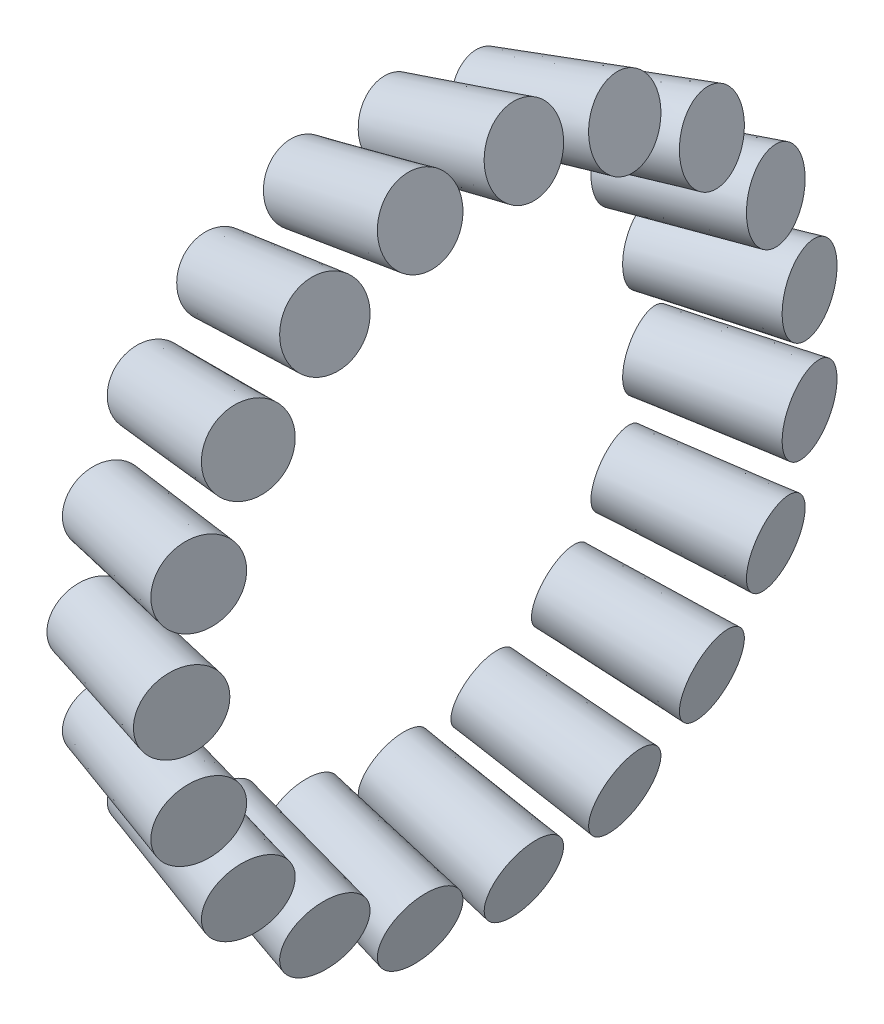
ISO-10303-21;
HEADER;
FILE_DESCRIPTION(('STEP AP214'),'2;1');
FILE_NAME('part.step','',(''),(''),'','','');
FILE_SCHEMA(('AUTOMOTIVE_DESIGN { 1 0 10303 214 1 1 1 1 }'));
ENDSEC;
DATA;
#1=APPLICATION_CONTEXT('core data for automotive mechanical design processes');
#2=APPLICATION_PROTOCOL_DEFINITION('international standard','automotive_design',2000,#1);
#3=PRODUCT_CONTEXT('',#1,'mechanical');
#4=PRODUCT('Part','Part','',(#3));
#5=PRODUCT_RELATED_PRODUCT_CATEGORY('part','',(#4));
#6=PRODUCT_DEFINITION_FORMATION('','',#4);
#7=PRODUCT_DEFINITION_CONTEXT('part definition',#1,'design');
#8=PRODUCT_DEFINITION('design','',#6,#7);
#9=PRODUCT_DEFINITION_SHAPE('','',#8);
#10=(LENGTH_UNIT() NAMED_UNIT(*) SI_UNIT(.MILLI.,.METRE.));
#11=(NAMED_UNIT(*) PLANE_ANGLE_UNIT() SI_UNIT($,.RADIAN.));
#12=(NAMED_UNIT(*) SI_UNIT($,.STERADIAN.) SOLID_ANGLE_UNIT());
#13=UNCERTAINTY_MEASURE_WITH_UNIT(LENGTH_MEASURE(1.E-05),#10,'distance_accuracy_value','');
#14=(GEOMETRIC_REPRESENTATION_CONTEXT(3) GLOBAL_UNCERTAINTY_ASSIGNED_CONTEXT((#13)) GLOBAL_UNIT_ASSIGNED_CONTEXT((#10,
#11,#12)) REPRESENTATION_CONTEXT('',''));
#15=CARTESIAN_POINT('',(0.,0.,0.));
#16=DIRECTION('',(0.,0.,1.));
#17=DIRECTION('',(1.,0.,0.));
#18=AXIS2_PLACEMENT_3D('',#15,#16,#17);
#19=CARTESIAN_POINT('',(1.5626523356005,0.,22.5310238552106));
#20=DIRECTION('',(-0.963195414363427,0.,-0.268802146102418));
#21=DIRECTION('',(-0.268802146102418,0.,0.963195414363427));
#22=AXIS2_PLACEMENT_3D('',#19,#20,#21);
#23=PLANE('',#22);
#24=CARTESIAN_POINT('',(1.9166017770261,0.,21.2627211878665));
#25=DIRECTION('',(0.963195414363428,0.,0.268802146102416));
#26=DIRECTION('',(0.268802146102416,0.,-0.963195414363428));
#27=AXIS2_PLACEMENT_3D('',#24,#25,#26);
#28=CIRCLE('',#27,2.63353136535976);
#29=CARTESIAN_POINT('',(2.62450065986283,0.,18.7261158531697));
#30=VERTEX_POINT('',#29);
#31=EDGE_CURVE('P0_E18',#30,#30,#28,.T.);
#32=ORIENTED_EDGE('',*,*,#31,.F.);
#33=EDGE_LOOP('',(#32));
#34=FACE_BOUND('',#33,.T.);
#35=ADVANCED_FACE('P0_F15',(#34),#23,.T.);
#36=CARTESIAN_POINT('',(11.1810493570371,0.,25.3887050045226));
#37=DIRECTION('',(0.963195414363427,0.,0.268802146102418));
#38=DIRECTION('',(0.268802146102418,0.,-0.963195414363427));
#39=AXIS2_PLACEMENT_3D('',#36,#37,#38);
#40=PLANE('',#39);
#41=CARTESIAN_POINT('',(11.5799047821866,0.,23.9594912798855));
#42=DIRECTION('',(0.963195414363428,0.,0.268802146102416));
#43=DIRECTION('',(0.268802146102416,0.,-0.963195414363428));
#44=AXIS2_PLACEMENT_3D('',#41,#42,#43);
#45=CIRCLE('',#44,2.96765059995608);
#46=CARTESIAN_POINT('',(12.377615632337,0.,21.1010638305749));
#47=VERTEX_POINT('',#46);
#48=EDGE_CURVE('P0_E10',#47,#47,#45,.F.);
#49=ORIENTED_EDGE('',*,*,#48,.F.);
#50=EDGE_LOOP('',(#49));
#51=FACE_BOUND('',#50,.T.);
#52=ADVANCED_FACE('P0_F30',(#51),#40,.T.);
#53=CARTESIAN_POINT('',(11.5799047820547,0.,23.9594912798486));
#54=DIRECTION('',(0.963195414363428,0.,0.268802146102416));
#55=DIRECTION('',(0.268802146102416,0.,-0.963195414363428));
#56=AXIS2_PLACEMENT_3D('',#53,#54,#55);
#57=CONICAL_SURFACE('',#56,2.96765059995151,0.0332912269457585);
#58=ORIENTED_EDGE('',*,*,#31,.T.);
#59=EDGE_LOOP('',(#58));
#60=FACE_BOUND('',#59,.T.);
#61=ORIENTED_EDGE('',*,*,#48,.T.);
#62=EDGE_LOOP('',(#61));
#63=FACE_BOUND('',#62,.T.);
#64=ADVANCED_FACE('P0_F27',(#60,#63),#57,.T.);
#65=CLOSED_SHELL('',(#35,#52,#64));
#66=MANIFOLD_SOLID_BREP('P0_B1',#65);
#67=CARTESIAN_POINT('',(1.5626523356005,-22.4540689856662,-1.8605972027848));
#68=DIRECTION('',(-0.963195414363427,0.267884050492583,0.0221975052866959));
#69=DIRECTION('',(-0.267950072044078,-0.963432799364633,0.));
#70=AXIS2_PLACEMENT_3D('',#67,#68,#69);
#71=PLANE('',#70);
#72=CARTESIAN_POINT('',(1.91660177690901,-21.1900982149196,-1.755861598652));
#73=DIRECTION('',(0.963195414363429,-0.267884050492579,-0.0221975052866969));
#74=DIRECTION('',(0.267950072044074,0.963432799364634,0.));
#75=AXIS2_PLACEMENT_3D('',#72,#73,#74);
#76=CIRCLE('',#75,2.63353136535399);
#77=CARTESIAN_POINT('',(2.62225669598594,-18.652867719382,-1.755861598652));
#78=VERTEX_POINT('',#77);
#79=EDGE_CURVE('P1_E18',#78,#78,#76,.T.);
#80=ORIENTED_EDGE('',*,*,#79,.F.);
#81=EDGE_LOOP('',(#80));
#82=FACE_BOUND('',#81,.T.);
#83=ADVANCED_FACE('P1_F15',(#82),#71,.T.);
#84=CARTESIAN_POINT('',(11.1810493570371,-25.3019897050281,-2.09658264166361));
#85=DIRECTION('',(0.963195414363427,-0.267884050492583,-0.0221975052866959));
#86=DIRECTION('',(0.267950072044078,0.963432799364633,0.));
#87=AXIS2_PLACEMENT_3D('',#84,#85,#86);
#88=PLANE('',#87);
#89=CARTESIAN_POINT('',(11.5799047822032,-23.877657469867,-1.97855910774338));
#90=DIRECTION('',(0.963195414363429,-0.267884050492579,-0.0221975052866969));
#91=DIRECTION('',(0.267950072044074,0.963432799364634,0.));
#92=AXIS2_PLACEMENT_3D('',#89,#90,#91);
#93=CIRCLE('',#92,2.96765059997999);
#94=CARTESIAN_POINT('',(12.3750869742695,-21.0185255447921,-1.97855910774338));
#95=VERTEX_POINT('',#94);
#96=EDGE_CURVE('P1_E10',#95,#95,#93,.F.);
#97=ORIENTED_EDGE('',*,*,#96,.F.);
#98=EDGE_LOOP('',(#97));
#99=FACE_BOUND('',#98,.T.);
#100=ADVANCED_FACE('P1_F30',(#99),#88,.T.);
#101=CARTESIAN_POINT('',(11.5799047821932,-23.8776574698642,-1.97855910774315));
#102=DIRECTION('',(0.963195414363429,-0.267884050492579,-0.0221975052866969));
#103=DIRECTION('',(0.267950072044074,0.963432799364634,0.));
#104=AXIS2_PLACEMENT_3D('',#101,#102,#103);
#105=CONICAL_SURFACE('',#104,2.96765059997964,0.033291226948253);
#106=ORIENTED_EDGE('',*,*,#96,.T.);
#107=EDGE_LOOP('',(#106));
#108=FACE_BOUND('',#107,.T.);
#109=ORIENTED_EDGE('',*,*,#79,.T.);
#110=EDGE_LOOP('',(#109));
#111=FACE_BOUND('',#110,.T.);
#112=ADVANCED_FACE('P1_F27',(#108,#111),#105,.T.);
#113=CLOSED_SHELL('',(#83,#100,#112));
#114=MANIFOLD_SOLID_BREP('P1_B1',#113);
#115=CARTESIAN_POINT('',(1.5626523356005,13.8388412817845,17.7801436423232));
#116=DIRECTION('',(-0.963195414363427,-0.165101695334371,-0.212122662502106));
#117=DIRECTION('',(-0.215074223164244,0.,0.976597705572923));
#118=AXIS2_PLACEMENT_3D('',#115,#116,#117);
#119=PLANE('',#118);
#120=CARTESIAN_POINT('',(1.91660177704468,13.0598336599667,16.7792746293505));
#121=DIRECTION('',(0.963195414363426,0.165101695334375,0.212122662502107));
#122=DIRECTION('',(0.215074223164245,0.,-0.976597705572922));
#123=AXIS2_PLACEMENT_3D('',#120,#121,#122);
#124=CIRCLE('',#123,2.6335313653514);
#125=CARTESIAN_POINT('',(2.48300648962631,13.0598336599667,14.207373940394));
#126=VERTEX_POINT('',#125);
#127=EDGE_CURVE('P2_E18',#126,#126,#124,.T.);
#128=ORIENTED_EDGE('',*,*,#127,.F.);
#129=EDGE_LOOP('',(#128));
#130=FACE_BOUND('',#129,.T.);
#131=ADVANCED_FACE('P2_F15',(#130),#119,.T.);
#132=CARTESIAN_POINT('',(11.1810493570371,15.5940653725056,20.0352556001837));
#133=DIRECTION('',(0.963195414363427,0.16510169533437,0.212122662502106));
#134=DIRECTION('',(0.215074223164244,0.,-0.976597705572923));
#135=AXIS2_PLACEMENT_3D('',#132,#133,#134);
#136=PLANE('',#135);
#137=CARTESIAN_POINT('',(11.5799047822593,14.7162241336953,18.9074051535033));
#138=DIRECTION('',(0.963195414363426,0.165101695334375,0.212122662502107));
#139=DIRECTION('',(0.215074223164245,0.,-0.976597705572922));
#140=AXIS2_PLACEMENT_3D('',#137,#138,#139);
#141=CIRCLE('',#140,2.96765059996206);
#142=CARTESIAN_POINT('',(12.2181699296691,14.7162241336953,16.0092043866382));
#143=VERTEX_POINT('',#142);
#144=EDGE_CURVE('P2_E10',#143,#143,#141,.F.);
#145=ORIENTED_EDGE('',*,*,#144,.F.);
#146=EDGE_LOOP('',(#145));
#147=FACE_BOUND('',#146,.T.);
#148=ADVANCED_FACE('P2_F30',(#147),#136,.T.);
#149=CARTESIAN_POINT('',(11.5799047823146,14.7162241337048,18.9074051535154));
#150=DIRECTION('',(0.963195414363426,0.165101695334375,0.212122662502107));
#151=DIRECTION('',(0.215074223164245,0.,-0.976597705572922));
#152=AXIS2_PLACEMENT_3D('',#149,#150,#151);
#153=CONICAL_SURFACE('',#152,2.96765059996397,0.0332912269470001);
#154=ORIENTED_EDGE('',*,*,#144,.T.);
#155=EDGE_LOOP('',(#154));
#156=FACE_BOUND('',#155,.T.);
#157=ORIENTED_EDGE('',*,*,#127,.T.);
#158=EDGE_LOOP('',(#157));
#159=FACE_BOUND('',#158,.T.);
#160=ADVANCED_FACE('P2_F27',(#156,#159),#153,.T.);
#161=CLOSED_SHELL('',(#131,#148,#160));
#162=MANIFOLD_SOLID_BREP('P2_B1',#161);
#163=CARTESIAN_POINT('',(1.5626523356005,18.8622178925157,12.3233019982199));
#164=DIRECTION('',(-0.963195414363427,-0.225032146001971,-0.147020838710073));
#165=DIRECTION('',(0.227504345878125,-0.973777065147135,0.));
#166=AXIS2_PLACEMENT_3D('',#163,#164,#165);
#167=PLANE('',#166);
#168=CARTESIAN_POINT('',(1.91660177700274,17.8004374151186,11.6296061903706));
#169=DIRECTION('',(0.963195414363422,0.225032146001991,0.14702083871008));
#170=DIRECTION('',(-0.227504345878145,0.97377706514713,0.));
#171=AXIS2_PLACEMENT_3D('',#168,#169,#170);
#172=CIRCLE('',#171,2.63353136538004);
#173=CARTESIAN_POINT('',(1.31746194637238,20.3649098590713,11.6296061903706));
#174=VERTEX_POINT('',#173);
#175=EDGE_CURVE('P3_E18',#174,#174,#172,.T.);
#176=ORIENTED_EDGE('',*,*,#175,.F.);
#177=EDGE_LOOP('',(#176));
#178=FACE_BOUND('',#177,.T.);
#179=ADVANCED_FACE('P3_F15',(#178),#167,.T.);
#180=CARTESIAN_POINT('',(11.1810493570371,21.2545727562824,13.8863054393373));
#181=DIRECTION('',(0.963195414363427,0.225032146001971,0.147020838710073));
#182=DIRECTION('',(-0.227504345878125,0.973777065147135,0.));
#183=AXIS2_PLACEMENT_3D('',#180,#181,#182);
#184=PLANE('',#183);
#185=CARTESIAN_POINT('',(11.5799047820923,20.0580829357214,13.1045996250693));
#186=DIRECTION('',(0.963195414363422,0.225032146001991,0.14702083871008));
#187=DIRECTION('',(-0.227504345878145,0.97377706514713,0.));
#188=AXIS2_PLACEMENT_3D('',#185,#186,#187);
#189=CIRCLE('',#188,2.96765059995125);
#190=CARTESIAN_POINT('',(10.9047513735555,22.9479130273241,13.1045996250693));
#191=VERTEX_POINT('',#190);
#192=EDGE_CURVE('P3_E10',#191,#191,#189,.F.);
#193=ORIENTED_EDGE('',*,*,#192,.F.);
#194=EDGE_LOOP('',(#193));
#195=FACE_BOUND('',#194,.T.);
#196=ADVANCED_FACE('P3_F30',(#195),#184,.T.);
#197=CARTESIAN_POINT('',(11.579904781825,20.058082935659,13.1045996250285));
#198=DIRECTION('',(0.963195414363422,0.225032146001991,0.14702083871008));
#199=DIRECTION('',(-0.227504345878145,0.97377706514713,0.));
#200=AXIS2_PLACEMENT_3D('',#197,#198,#199);
#201=CONICAL_SURFACE('',#200,2.96765059994201,0.033291226943502);
#202=ORIENTED_EDGE('',*,*,#175,.T.);
#203=EDGE_LOOP('',(#202));
#204=FACE_BOUND('',#203,.T.);
#205=ORIENTED_EDGE('',*,*,#192,.T.);
#206=EDGE_LOOP('',(#205));
#207=FACE_BOUND('',#206,.T.);
#208=ADVANCED_FACE('P3_F27',(#204,#207),#201,.T.);
#209=CLOSED_SHELL('',(#179,#196,#208));
#210=MANIFOLD_SOLID_BREP('P3_B1',#209);
#211=CARTESIAN_POINT('',(1.5626523356005,-18.8622178925157,12.3233019982199));
#212=DIRECTION('',(-0.963195414363427,0.225032146001971,-0.147020838710073));
#213=DIRECTION('',(-0.227504345878125,-0.973777065147134,0.));
#214=AXIS2_PLACEMENT_3D('',#211,#212,#213);
#215=PLANE('',#214);
#216=CARTESIAN_POINT('',(1.91660177694288,-17.8004374151047,11.6296061903615));
#217=DIRECTION('',(0.963195414363423,-0.225032146001984,0.14702083871008));
#218=DIRECTION('',(0.227504345878138,0.973777065147131,0.));
#219=AXIS2_PLACEMENT_3D('',#216,#217,#218);
#220=CIRCLE('',#219,2.63353136534635);
#221=CARTESIAN_POINT('',(2.51574160756557,-15.2359649711848,11.6296061903615));
#222=VERTEX_POINT('',#221);
#223=EDGE_CURVE('P4_E18',#222,#222,#220,.T.);
#224=ORIENTED_EDGE('',*,*,#223,.F.);
#225=EDGE_LOOP('',(#224));
#226=FACE_BOUND('',#225,.T.);
#227=ADVANCED_FACE('P4_F15',(#226),#215,.T.);
#228=CARTESIAN_POINT('',(11.1810493570371,-21.2545727562824,13.8863054393373));
#229=DIRECTION('',(0.963195414363427,-0.225032146001971,0.147020838710073));
#230=DIRECTION('',(0.227504345878125,0.973777065147134,0.));
#231=AXIS2_PLACEMENT_3D('',#228,#229,#230);
#232=PLANE('',#231);
#233=CARTESIAN_POINT('',(11.5799047823543,-20.0580829357826,13.1045996251093));
#234=DIRECTION('',(0.963195414363423,-0.225032146001984,0.14702083871008));
#235=DIRECTION('',(0.227504345878138,0.973777065147131,0.));
#236=AXIS2_PLACEMENT_3D('',#233,#234,#235);
#237=CIRCLE('',#236,2.96765059996146);
#238=CARTESIAN_POINT('',(12.2550581908934,-17.1682528441701,13.1045996251093));
#239=VERTEX_POINT('',#238);
#240=EDGE_CURVE('P4_E10',#239,#239,#237,.F.);
#241=ORIENTED_EDGE('',*,*,#240,.F.);
#242=EDGE_LOOP('',(#241));
#243=FACE_BOUND('',#242,.T.);
#244=ADVANCED_FACE('P4_F30',(#243),#232,.T.);
#245=CARTESIAN_POINT('',(11.5799047822211,-20.0580829357515,13.104599625089));
#246=DIRECTION('',(0.963195414363423,-0.225032146001984,0.14702083871008));
#247=DIRECTION('',(0.227504345878138,0.973777065147131,0.));
#248=AXIS2_PLACEMENT_3D('',#245,#246,#247);
#249=CONICAL_SURFACE('',#248,2.96765059995685,0.033291226946765);
#250=ORIENTED_EDGE('',*,*,#240,.T.);
#251=EDGE_LOOP('',(#250));
#252=FACE_BOUND('',#251,.T.);
#253=ORIENTED_EDGE('',*,*,#223,.T.);
#254=EDGE_LOOP('',(#253));
#255=FACE_BOUND('',#254,.T.);
#256=ADVANCED_FACE('P4_F27',(#252,#255),#249,.T.);
#257=CLOSED_SHELL('',(#227,#244,#256));
#258=MANIFOLD_SOLID_BREP('P4_B1',#257);
#259=CARTESIAN_POINT('',(1.5626523356005,22.4540689856662,-1.86059720278479));
#260=DIRECTION('',(-0.963195414363427,-0.267884050492583,0.0221975052866957));
#261=DIRECTION('',(0.267950072044078,-0.963432799364633,0.));
#262=AXIS2_PLACEMENT_3D('',#259,#260,#261);
#263=PLANE('',#262);
#264=CARTESIAN_POINT('',(1.91660177702257,21.190098214951,-1.75586159865461));
#265=DIRECTION('',(0.963195414363425,0.267884050492593,-0.0221975052866964));
#266=DIRECTION('',(-0.267950072044088,0.96343279936463,0.));
#267=AXIS2_PLACEMENT_3D('',#264,#265,#266);
#268=CIRCLE('',#267,2.63353136533571);
#269=CARTESIAN_POINT('',(1.2109468579505,23.727328710471,-1.75586159865461));
#270=VERTEX_POINT('',#269);
#271=EDGE_CURVE('P5_E18',#270,#270,#268,.T.);
#272=ORIENTED_EDGE('',*,*,#271,.F.);
#273=EDGE_LOOP('',(#272));
#274=FACE_BOUND('',#273,.T.);
#275=ADVANCED_FACE('P5_F15',(#274),#263,.T.);
#276=CARTESIAN_POINT('',(11.1810493570371,25.3019897050281,-2.09658264166359));
#277=DIRECTION('',(0.963195414363427,0.267884050492583,-0.0221975052866957));
#278=DIRECTION('',(-0.267950072044078,0.963432799364633,0.));
#279=AXIS2_PLACEMENT_3D('',#276,#277,#278);
#280=PLANE('',#279);
#281=CARTESIAN_POINT('',(11.5799047820702,23.87765746983,-1.9785591077403));
#282=DIRECTION('',(0.963195414363425,0.267884050492593,-0.0221975052866964));
#283=DIRECTION('',(-0.267950072044088,0.96343279936463,0.));
#284=AXIS2_PLACEMENT_3D('',#281,#282,#283);
#285=CIRCLE('',#284,2.96765059995395);
#286=CARTESIAN_POINT('',(10.7847225900108,26.7367893948797,-1.9785591077403));
#287=VERTEX_POINT('',#286);
#288=EDGE_CURVE('P5_E10',#287,#287,#285,.F.);
#289=ORIENTED_EDGE('',*,*,#288,.F.);
#290=EDGE_LOOP('',(#289));
#291=FACE_BOUND('',#290,.T.);
#292=ADVANCED_FACE('P5_F30',(#291),#280,.T.);
#293=CARTESIAN_POINT('',(11.5799047819619,23.8776574697999,-1.9785591077378));
#294=DIRECTION('',(0.963195414363425,0.267884050492593,-0.0221975052866964));
#295=DIRECTION('',(-0.267950072044088,0.96343279936463,0.));
#296=AXIS2_PLACEMENT_3D('',#293,#294,#295);
#297=CONICAL_SURFACE('',#296,2.96765059995021,0.0332912269483301);
#298=ORIENTED_EDGE('',*,*,#271,.T.);
#299=EDGE_LOOP('',(#298));
#300=FACE_BOUND('',#299,.T.);
#301=ORIENTED_EDGE('',*,*,#288,.T.);
#302=EDGE_LOOP('',(#301));
#303=FACE_BOUND('',#302,.T.);
#304=ADVANCED_FACE('P5_F27',(#300,#303),#297,.T.);
#305=CLOSED_SHELL('',(#275,#292,#304));
#306=MANIFOLD_SOLID_BREP('P5_B1',#305);
#307=CARTESIAN_POINT('',(1.5626523356005,-3.70848464005382,-22.2237300568234));
#308=DIRECTION('',(-0.963195414363427,0.0442433791043094,0.26513603518703));
#309=DIRECTION('',(0.265395915573286,0.,0.964139516873475));
#310=AXIS2_PLACEMENT_3D('',#307,#308,#309);
#311=PLANE('',#310);
#312=CARTESIAN_POINT('',(1.91660177689485,-3.49972888216432,-20.9727253847165));
#313=DIRECTION('',(0.963195414363426,-0.0442433791043105,-0.265136035187036));
#314=DIRECTION('',(-0.265395915573292,0.,-0.964139516873473));
#315=AXIS2_PLACEMENT_3D('',#312,#313,#314);
#316=CIRCLE('',#315,2.6335313653806);
#317=CARTESIAN_POINT('',(1.21767330898869,-3.49972888216432,-23.5118170430057));
#318=VERTEX_POINT('',#317);
#319=EDGE_CURVE('P6_E18',#318,#318,#316,.T.);
#320=ORIENTED_EDGE('',*,*,#319,.F.);
#321=EDGE_LOOP('',(#320));
#322=FACE_BOUND('',#321,.T.);
#323=ADVANCED_FACE('P6_F15',(#322),#311,.T.);
#324=CARTESIAN_POINT('',(11.1810493570371,-4.17884349797781,-25.0424361599681));
#325=DIRECTION('',(0.963195414363427,-0.0442433791043094,-0.26513603518703));
#326=DIRECTION('',(-0.265395915573286,0.,-0.964139516873475));
#327=AXIS2_PLACEMENT_3D('',#324,#325,#326);
#328=PLANE('',#327);
#329=CARTESIAN_POINT('',(11.5799047822645,-3.94360265055113,-23.6327150477154));
#330=DIRECTION('',(0.963195414363426,-0.0442433791043105,-0.265136035187036));
#331=DIRECTION('',(-0.265395915573292,0.,-0.964139516873473));
#332=AXIS2_PLACEMENT_3D('',#329,#330,#331);
#333=CIRCLE('',#332,2.96765060000158);
#334=CARTESIAN_POINT('',(10.7923024341755,-3.94360265055113,-26.4939442634502));
#335=VERTEX_POINT('',#334);
#336=EDGE_CURVE('P6_E10',#335,#335,#333,.F.);
#337=ORIENTED_EDGE('',*,*,#336,.F.);
#338=EDGE_LOOP('',(#337));
#339=FACE_BOUND('',#338,.T.);
#340=ADVANCED_FACE('P6_F30',(#339),#328,.T.);
#341=CARTESIAN_POINT('',(11.5799047821715,-3.94360265054686,-23.6327150476898));
#342=DIRECTION('',(0.963195414363426,-0.0442433791043105,-0.265136035187036));
#343=DIRECTION('',(-0.265395915573292,0.,-0.964139516873473));
#344=AXIS2_PLACEMENT_3D('',#341,#342,#343);
#345=CONICAL_SURFACE('',#344,2.96765059999837,0.0332912269474935);
#346=ORIENTED_EDGE('',*,*,#319,.T.);
#347=EDGE_LOOP('',(#346));
#348=FACE_BOUND('',#347,.T.);
#349=ORIENTED_EDGE('',*,*,#336,.T.);
#350=EDGE_LOOP('',(#349));
#351=FACE_BOUND('',#350,.T.);
#352=ADVANCED_FACE('P6_F27',(#348,#351),#345,.T.);
#353=CLOSED_SHELL('',(#323,#340,#352));
#354=MANIFOLD_SOLID_BREP('P6_B1',#353);
#355=CARTESIAN_POINT('',(1.5626523356005,-13.8388412817845,17.7801436423232));
#356=DIRECTION('',(-0.963195414363427,0.165101695334371,-0.212122662502106));
#357=DIRECTION('',(-0.215074223164244,0.,0.976597705572923));
#358=AXIS2_PLACEMENT_3D('',#355,#356,#357);
#359=PLANE('',#358);
#360=CARTESIAN_POINT('',(1.91660177698386,-13.0598336599563,16.7792746293371));
#361=DIRECTION('',(0.963195414363425,-0.165101695334375,0.212122662502115));
#362=DIRECTION('',(0.215074223164253,0.,-0.976597705572921));
#363=AXIS2_PLACEMENT_3D('',#360,#361,#362);
#364=CIRCLE('',#363,2.63353136536383);
#365=CARTESIAN_POINT('',(2.48300648956818,-13.0598336599563,14.2073739403684));
#366=VERTEX_POINT('',#365);
#367=EDGE_CURVE('P7_E18',#366,#366,#364,.T.);
#368=ORIENTED_EDGE('',*,*,#367,.F.);
#369=EDGE_LOOP('',(#368));
#370=FACE_BOUND('',#369,.T.);
#371=ADVANCED_FACE('P7_F15',(#370),#359,.T.);
#372=CARTESIAN_POINT('',(11.1810493570371,-15.5940653725056,20.0352556001837));
#373=DIRECTION('',(0.963195414363427,-0.165101695334371,0.212122662502106));
#374=DIRECTION('',(0.215074223164244,0.,-0.976597705572923));
#375=AXIS2_PLACEMENT_3D('',#372,#373,#374);
#376=PLANE('',#375);
#377=CARTESIAN_POINT('',(11.5799047823056,-14.7162241337033,18.9074051535135));
#378=DIRECTION('',(0.963195414363425,-0.165101695334375,0.212122662502115));
#379=DIRECTION('',(0.215074223164253,0.,-0.976597705572921));
#380=AXIS2_PLACEMENT_3D('',#377,#378,#379);
#381=CIRCLE('',#380,2.96765059999527);
#382=CARTESIAN_POINT('',(12.2181699297225,-14.7162241337033,16.009204386616));
#383=VERTEX_POINT('',#382);
#384=EDGE_CURVE('P7_E10',#383,#383,#381,.F.);
#385=ORIENTED_EDGE('',*,*,#384,.F.);
#386=EDGE_LOOP('',(#385));
#387=FACE_BOUND('',#386,.T.);
#388=ADVANCED_FACE('P7_F30',(#387),#376,.T.);
#389=CARTESIAN_POINT('',(11.5799047822508,-14.7162241336939,18.9074051535014));
#390=DIRECTION('',(0.963195414363425,-0.165101695334375,0.212122662502115));
#391=DIRECTION('',(0.215074223164253,0.,-0.976597705572921));
#392=AXIS2_PLACEMENT_3D('',#389,#390,#391);
#393=CONICAL_SURFACE('',#392,2.96765059999338,0.0332912269487001);
#394=ORIENTED_EDGE('',*,*,#384,.T.);
#395=EDGE_LOOP('',(#394));
#396=FACE_BOUND('',#395,.T.);
#397=ORIENTED_EDGE('',*,*,#367,.T.);
#398=EDGE_LOOP('',(#397));
#399=FACE_BOUND('',#398,.T.);
#400=ADVANCED_FACE('P7_F27',(#396,#399),#393,.T.);
#401=CLOSED_SHELL('',(#371,#388,#400));
#402=MANIFOLD_SOLID_BREP('P7_B1',#401);
#403=CARTESIAN_POINT('',(1.5626523356005,-10.7235820663436,-19.815444068465));
#404=DIRECTION('',(-0.963195414363427,0.127935680680216,0.236404431765048));
#405=DIRECTION('',(0.238363189166818,0.,0.971176086016446));
#406=AXIS2_PLACEMENT_3D('',#403,#404,#405);
#407=PLANE('',#406);
#408=CARTESIAN_POINT('',(1.91660177704585,-10.1199367182418,-18.7000051639554));
#409=DIRECTION('',(0.963195414363424,-0.12793568068022,-0.236404431765058));
#410=DIRECTION('',(-0.238363189166828,0.,-0.971176086016444));
#411=AXIS2_PLACEMENT_3D('',#408,#409,#410);
#412=CIRCLE('',#411,2.63353136537429);
#413=CARTESIAN_POINT('',(1.28886484202436,-10.1199367182418,-21.2576278477811));
#414=VERTEX_POINT('',#413);
#415=EDGE_CURVE('P8_E18',#414,#414,#412,.T.);
#416=ORIENTED_EDGE('',*,*,#415,.F.);
#417=EDGE_LOOP('',(#416));
#418=FACE_BOUND('',#417,.T.);
#419=ADVANCED_FACE('P8_F15',(#418),#407,.T.);
#420=CARTESIAN_POINT('',(11.1810493570371,-12.0836879594898,-22.3286996286025));
#421=DIRECTION('',(0.963195414363427,-0.127935680680216,-0.236404431765048));
#422=DIRECTION('',(-0.238363189166818,0.,-0.971176086016446));
#423=AXIS2_PLACEMENT_3D('',#420,#421,#422);
#424=PLANE('',#423);
#425=CARTESIAN_POINT('',(11.5799047820376,-11.4034574131362,-21.0717436728834));
#426=DIRECTION('',(0.963195414363424,-0.12793568068022,-0.236404431765058));
#427=DIRECTION('',(-0.238363189166828,0.,-0.971176086016444));
#428=AXIS2_PLACEMENT_3D('',#425,#426,#427);
#429=CIRCLE('',#428,2.96765059996377);
#430=CARTESIAN_POINT('',(10.8725261206974,-11.4034574131362,-23.9538549672206));
#431=VERTEX_POINT('',#430);
#432=EDGE_CURVE('P8_E10',#431,#431,#429,.F.);
#433=ORIENTED_EDGE('',*,*,#432,.F.);
#434=EDGE_LOOP('',(#433));
#435=FACE_BOUND('',#434,.T.);
#436=ADVANCED_FACE('P8_F30',(#435),#424,.T.);
#437=CARTESIAN_POINT('',(11.5799047819769,-11.4034574131281,-21.0717436728685));
#438=DIRECTION('',(0.963195414363424,-0.12793568068022,-0.236404431765058));
#439=DIRECTION('',(-0.238363189166828,0.,-0.971176086016444));
#440=AXIS2_PLACEMENT_3D('',#437,#438,#439);
#441=CONICAL_SURFACE('',#440,2.96765059996167,0.0332912269456588);
#442=ORIENTED_EDGE('',*,*,#432,.T.);
#443=EDGE_LOOP('',(#442));
#444=FACE_BOUND('',#443,.T.);
#445=ORIENTED_EDGE('',*,*,#415,.T.);
#446=EDGE_LOOP('',(#445));
#447=FACE_BOUND('',#446,.T.);
#448=ADVANCED_FACE('P8_F27',(#444,#447),#441,.T.);
#449=CLOSED_SHELL('',(#419,#436,#448));
#450=MANIFOLD_SOLID_BREP('P8_B1',#449);
#451=CARTESIAN_POINT('',(1.5626523356005,-20.6333106688307,-9.05060919538501));
#452=DIRECTION('',(-0.963195414363427,0.24616183554823,0.10797659222624));
#453=DIRECTION('',(-0.247609500186071,-0.968859915270316,0.));
#454=AXIS2_PLACEMENT_3D('',#451,#452,#453);
#455=PLANE('',#454);
#456=CARTESIAN_POINT('',(1.91660177700679,-19.4718329159465,-8.54113781683553));
#457=DIRECTION('',(0.963195414363426,-0.246161835548235,-0.107976592226243));
#458=DIRECTION('',(0.247609500186076,0.968859915270315,0.));
#459=AXIS2_PLACEMENT_3D('',#456,#457,#458);
#460=CIRCLE('',#459,2.63353136533118);
#461=CARTESIAN_POINT('',(2.5686891621008,-16.92030994047,-8.54113781683553));
#462=VERTEX_POINT('',#461);
#463=EDGE_CURVE('P9_E18',#462,#462,#460,.T.);
#464=ORIENTED_EDGE('',*,*,#463,.F.);
#465=EDGE_LOOP('',(#464));
#466=FACE_BOUND('',#465,.T.);
#467=ADVANCED_FACE('P9_F15',(#466),#455,.T.);
#468=CARTESIAN_POINT('',(11.1810493570371,-23.2502988414556,-10.1985266381807));
#469=DIRECTION('',(0.963195414363427,-0.24616183554823,-0.10797659222624));
#470=DIRECTION('',(0.247609500186071,0.968859915270316,0.));
#471=AXIS2_PLACEMENT_3D('',#468,#469,#470);
#472=PLANE('',#471);
#473=CARTESIAN_POINT('',(11.5799047821834,-21.9414630343427,-9.62441802414235));
#474=DIRECTION('',(0.963195414363426,-0.246161835548235,-0.107976592226243));
#475=DIRECTION('',(0.247609500186076,0.968859915270315,0.));
#476=AXIS2_PLACEMENT_3D('',#473,#474,#475);
#477=CIRCLE('',#476,2.96765059997153);
#478=CARTESIAN_POINT('',(12.3147232639693,-19.0662253255024,-9.62441802414235));
#479=VERTEX_POINT('',#478);
#480=EDGE_CURVE('P9_E10',#479,#479,#477,.F.);
#481=ORIENTED_EDGE('',*,*,#480,.F.);
#482=EDGE_LOOP('',(#481));
#483=FACE_BOUND('',#482,.T.);
#484=ADVANCED_FACE('P9_F30',(#483),#472,.T.);
#485=CARTESIAN_POINT('',(11.5799047820565,-21.9414630343103,-9.62441802412812));
#486=DIRECTION('',(0.963195414363426,-0.246161835548235,-0.107976592226243));
#487=DIRECTION('',(0.247609500186076,0.968859915270315,0.));
#488=AXIS2_PLACEMENT_3D('',#485,#486,#487);
#489=CONICAL_SURFACE('',#488,2.96765059996714,0.0332912269500875);
#490=ORIENTED_EDGE('',*,*,#480,.T.);
#491=EDGE_LOOP('',(#490));
#492=FACE_BOUND('',#491,.T.);
#493=ORIENTED_EDGE('',*,*,#463,.T.);
#494=EDGE_LOOP('',(#493));
#495=FACE_BOUND('',#494,.T.);
#496=ADVANCED_FACE('P9_F27',(#492,#495),#489,.T.);
#497=CLOSED_SHELL('',(#467,#484,#496));
#498=MANIFOLD_SOLID_BREP('P9_B1',#497);
#499=CARTESIAN_POINT('',(1.5626523356005,-7.31581148642494,21.3102308354265));
#500=DIRECTION('',(-0.963195414363427,0.0872799141605349,-0.2542377043898));
#501=DIRECTION('',(-0.255211636221095,0.,0.966885215905876));
#502=AXIS2_PLACEMENT_3D('',#499,#500,#501);
#503=PLANE('',#502);
#504=CARTESIAN_POINT('',(1.91660177694899,-6.90399428354041,20.110648304937));
#505=DIRECTION('',(0.963195414363424,-0.0872799141605375,0.254237704389812));
#506=DIRECTION('',(0.255211636221108,0.,-0.966885215905872));
#507=AXIS2_PLACEMENT_3D('',#504,#505,#506);
#508=CIRCLE('',#507,2.63353136535663);
#509=CARTESIAN_POINT('',(2.58870962574127,-6.90399428354041,17.5643257621493));
#510=VERTEX_POINT('',#509);
#511=EDGE_CURVE('P10_E18',#510,#510,#508,.T.);
#512=ORIENTED_EDGE('',*,*,#511,.F.);
#513=EDGE_LOOP('',(#512));
#514=FACE_BOUND('',#513,.T.);
#515=ADVANCED_FACE('P10_F15',(#514),#503,.T.);
#516=CARTESIAN_POINT('',(11.1810493570371,-8.24369903876278,24.0130749377287));
#517=DIRECTION('',(0.963195414363427,-0.0872799141605349,0.2542377043898));
#518=DIRECTION('',(0.255211636221095,0.,-0.966885215905876));
#519=AXIS2_PLACEMENT_3D('',#516,#517,#518);
#520=PLANE('',#519);
#521=CARTESIAN_POINT('',(11.5799047823113,-7.77963410100434,22.6612999549246));
#522=DIRECTION('',(0.963195414363424,-0.0872799141605375,0.254237704389812));
#523=DIRECTION('',(0.255211636221108,0.,-0.966885215905872));
#524=AXIS2_PLACEMENT_3D('',#521,#522,#523);
#525=CIRCLE('',#524,2.96765059997582);
#526=CARTESIAN_POINT('',(12.3372837476637,-7.77963410100434,19.7919224638338));
#527=VERTEX_POINT('',#526);
#528=EDGE_CURVE('P10_E10',#527,#527,#525,.F.);
#529=ORIENTED_EDGE('',*,*,#528,.F.);
#530=EDGE_LOOP('',(#529));
#531=FACE_BOUND('',#530,.T.);
#532=ADVANCED_FACE('P10_F30',(#531),#520,.T.);
#533=CARTESIAN_POINT('',(11.579904782331,-7.77963410100613,22.6612999549298));
#534=DIRECTION('',(0.963195414363424,-0.0872799141605375,0.254237704389812));
#535=DIRECTION('',(0.255211636221108,0.,-0.966885215905872));
#536=AXIS2_PLACEMENT_3D('',#533,#534,#535);
#537=CONICAL_SURFACE('',#536,2.9676505999765,0.0332912269473411);
#538=ORIENTED_EDGE('',*,*,#528,.T.);
#539=EDGE_LOOP('',(#538));
#540=FACE_BOUND('',#539,.T.);
#541=ORIENTED_EDGE('',*,*,#511,.T.);
#542=EDGE_LOOP('',(#541));
#543=FACE_BOUND('',#542,.T.);
#544=ADVANCED_FACE('P10_F27',(#540,#543),#537,.T.);
#545=CLOSED_SHELL('',(#515,#532,#544));
#546=MANIFOLD_SOLID_BREP('P10_B1',#545);
#547=CARTESIAN_POINT('',(1.5626523356005,7.31581148642493,21.3102308354265));
#548=DIRECTION('',(-0.963195414363427,-0.0872799141605348,-0.2542377043898));
#549=DIRECTION('',(-0.255211636221095,0.,0.966885215905876));
#550=AXIS2_PLACEMENT_3D('',#547,#548,#549);
#551=PLANE('',#550);
#552=CARTESIAN_POINT('',(1.91660177693854,6.90399428353943,20.1106483049344));
#553=DIRECTION('',(0.963195414363426,0.0872799141605394,0.254237704389804));
#554=DIRECTION('',(0.255211636221099,0.,-0.966885215905874));
#555=AXIS2_PLACEMENT_3D('',#552,#553,#554);
#556=CIRCLE('',#555,2.63353136539794);
#557=CARTESIAN_POINT('',(2.58870962574133,6.90399428353943,17.5643257621067));
#558=VERTEX_POINT('',#557);
#559=EDGE_CURVE('P11_E18',#558,#558,#556,.T.);
#560=ORIENTED_EDGE('',*,*,#559,.F.);
#561=EDGE_LOOP('',(#560));
#562=FACE_BOUND('',#561,.T.);
#563=ADVANCED_FACE('P11_F15',(#562),#551,.T.);
#564=CARTESIAN_POINT('',(11.1810493570371,8.24369903876277,24.0130749377287));
#565=DIRECTION('',(0.963195414363427,0.0872799141605348,0.2542377043898));
#566=DIRECTION('',(0.255211636221095,0.,-0.966885215905876));
#567=AXIS2_PLACEMENT_3D('',#564,#565,#566);
#568=PLANE('',#567);
#569=CARTESIAN_POINT('',(11.5799047821379,7.77963410098862,22.6612999548788));
#570=DIRECTION('',(0.963195414363426,0.0872799141605394,0.254237704389804));
#571=DIRECTION('',(0.255211636221099,0.,-0.966885215905874));
#572=AXIS2_PLACEMENT_3D('',#569,#570,#571);
#573=CIRCLE('',#572,2.96765060000469);
#574=CARTESIAN_POINT('',(12.3372837474976,7.77963410098862,19.7919224637601));
#575=VERTEX_POINT('',#574);
#576=EDGE_CURVE('P11_E10',#575,#575,#573,.F.);
#577=ORIENTED_EDGE('',*,*,#576,.F.);
#578=EDGE_LOOP('',(#577));
#579=FACE_BOUND('',#578,.T.);
#580=ADVANCED_FACE('P11_F30',(#579),#568,.T.);
#581=CARTESIAN_POINT('',(11.5799047819844,7.77963410097471,22.6612999548383));
#582=DIRECTION('',(0.963195414363426,0.0872799141605394,0.254237704389804));
#583=DIRECTION('',(0.255211636221099,0.,-0.966885215905874));
#584=AXIS2_PLACEMENT_3D('',#581,#582,#583);
#585=CONICAL_SURFACE('',#584,2.96765059999938,0.0332912269466634);
#586=ORIENTED_EDGE('',*,*,#576,.T.);
#587=EDGE_LOOP('',(#586));
#588=FACE_BOUND('',#587,.T.);
#589=ORIENTED_EDGE('',*,*,#559,.T.);
#590=EDGE_LOOP('',(#589));
#591=FACE_BOUND('',#590,.T.);
#592=ADVANCED_FACE('P11_F27',(#588,#591),#585,.T.);
#593=CLOSED_SHELL('',(#563,#580,#592));
#594=MANIFOLD_SOLID_BREP('P11_B1',#593);
#595=CARTESIAN_POINT('',(1.5626523356005,-16.5766129822252,-15.2598472469941));
#596=DIRECTION('',(-0.963195414363427,0.197764166127801,0.182054739968618));
#597=DIRECTION('',(-0.201125292165767,-0.979565524531787,0.));
#598=AXIS2_PLACEMENT_3D('',#595,#596,#597);
#599=PLANE('',#598);
#600=CARTESIAN_POINT('',(1.91660177705357,-15.6434923838951,-14.4008492231633));
#601=DIRECTION('',(0.963195414363425,-0.19776416612781,-0.182054739968622));
#602=DIRECTION('',(0.201125292165776,0.979565524531785,0.));
#603=AXIS2_PLACEMENT_3D('',#600,#601,#602);
#604=CIRCLE('',#603,2.63353136535541);
#605=CARTESIAN_POINT('',(2.44627154233841,-13.0637758506199,-14.4008492231633));
#606=VERTEX_POINT('',#605);
#607=EDGE_CURVE('P12_E18',#606,#606,#604,.T.);
#608=ORIENTED_EDGE('',*,*,#607,.F.);
#609=EDGE_LOOP('',(#608));
#610=FACE_BOUND('',#609,.T.);
#611=ADVANCED_FACE('P12_F15',(#610),#599,.T.);
#612=CARTESIAN_POINT('',(11.1810493570371,-18.6790773328539,-17.1953020270054));
#613=DIRECTION('',(0.963195414363427,-0.197764166127801,-0.182054739968618));
#614=DIRECTION('',(0.201125292165767,0.979565524531787,0.));
#615=AXIS2_PLACEMENT_3D('',#612,#613,#614);
#616=PLANE('',#615);
#617=CARTESIAN_POINT('',(11.5799047821433,-17.6275706221672,-16.2273219093859));
#618=DIRECTION('',(0.963195414363425,-0.19776416612781,-0.182054739968622));
#619=DIRECTION('',(0.201125292165776,0.979565524531785,0.));
#620=AXIS2_PLACEMENT_3D('',#617,#618,#619);
#621=CIRCLE('',#620,2.96765059994802);
#622=CARTESIAN_POINT('',(12.1767743761038,-14.7205624056021,-16.2273219093859));
#623=VERTEX_POINT('',#622);
#624=EDGE_CURVE('P12_E10',#623,#623,#621,.F.);
#625=ORIENTED_EDGE('',*,*,#624,.F.);
#626=EDGE_LOOP('',(#625));
#627=FACE_BOUND('',#626,.T.);
#628=ADVANCED_FACE('P12_F30',(#627),#616,.T.);
#629=CARTESIAN_POINT('',(11.579904782293,-17.627570622198,-16.2273219094142));
#630=DIRECTION('',(0.963195414363425,-0.19776416612781,-0.182054739968622));
#631=DIRECTION('',(0.201125292165776,0.979565524531785,0.));
#632=AXIS2_PLACEMENT_3D('',#629,#630,#631);
#633=CONICAL_SURFACE('',#632,2.96765059995319,0.0332912269456329);
#634=ORIENTED_EDGE('',*,*,#624,.T.);
#635=EDGE_LOOP('',(#634));
#636=FACE_BOUND('',#635,.T.);
#637=ORIENTED_EDGE('',*,*,#607,.T.);
#638=EDGE_LOOP('',(#637));
#639=FACE_BOUND('',#638,.T.);
#640=ADVANCED_FACE('P12_F27',(#636,#639),#633,.T.);
#641=CLOSED_SHELL('',(#611,#628,#640));
#642=MANIFOLD_SOLID_BREP('P12_B1',#641);
#643=CARTESIAN_POINT('',(1.5626523356005,-21.8415805171266,5.53103936687734));
#644=DIRECTION('',(-0.963195414363427,0.260576871916747,-0.0659870257804444));
#645=DIRECTION('',(-0.261146044666439,-0.965299302473111,0.));
#646=AXIS2_PLACEMENT_3D('',#643,#644,#645);
#647=PLANE('',#646);
#648=CARTESIAN_POINT('',(1.91660177702222,-20.6120875741105,5.21968946874209));
#649=DIRECTION('',(0.963195414363426,-0.260576871916752,0.0659870257804476));
#650=DIRECTION('',(0.261146044666445,0.965299302473109,0.));
#651=AXIS2_PLACEMENT_3D('',#648,#649,#650);
#652=CIRCLE('',#651,2.63353136537593);
#653=CARTESIAN_POINT('',(2.60433807659516,-18.0699415840721,5.21968946874209));
#654=VERTEX_POINT('',#653);
#655=EDGE_CURVE('P13_E18',#654,#654,#652,.T.);
#656=ORIENTED_EDGE('',*,*,#655,.F.);
#657=EDGE_LOOP('',(#656));
#658=FACE_BOUND('',#657,.T.);
#659=ADVANCED_FACE('P13_F15',(#658),#647,.T.);
#660=CARTESIAN_POINT('',(11.1810493570371,-24.6118173832394,6.23255861590927));
#661=DIRECTION('',(0.963195414363427,-0.260576871916747,0.0659870257804444));
#662=DIRECTION('',(0.261146044666439,0.965299302473111,0.));
#663=AXIS2_PLACEMENT_3D('',#660,#661,#662);
#664=PLANE('',#663);
#665=CARTESIAN_POINT('',(11.5799047820962,-23.2263372184675,5.88170738848221));
#666=DIRECTION('',(0.963195414363426,-0.260576871916752,0.0659870257804476));
#667=DIRECTION('',(0.261146044666445,0.965299302473109,0.));
#668=AXIS2_PLACEMENT_3D('',#665,#666,#667);
#669=CIRCLE('',#668,2.96765059998148);
#670=CARTESIAN_POINT('',(12.3548949982333,-20.3616661643215,5.88170738848221));
#671=VERTEX_POINT('',#670);
#672=EDGE_CURVE('P13_E10',#671,#671,#669,.F.);
#673=ORIENTED_EDGE('',*,*,#672,.F.);
#674=EDGE_LOOP('',(#673));
#675=FACE_BOUND('',#674,.T.);
#676=ADVANCED_FACE('P13_F30',(#675),#664,.T.);
#677=CARTESIAN_POINT('',(11.5799047820885,-23.2263372184655,5.88170738848168));
#678=DIRECTION('',(0.963195414363426,-0.260576871916752,0.0659870257804476));
#679=DIRECTION('',(0.261146044666445,0.965299302473109,0.));
#680=AXIS2_PLACEMENT_3D('',#677,#678,#679);
#681=CONICAL_SURFACE('',#680,2.96765059998122,0.0332912269469757);
#682=ORIENTED_EDGE('',*,*,#655,.T.);
#683=EDGE_LOOP('',(#682));
#684=FACE_BOUND('',#683,.T.);
#685=ORIENTED_EDGE('',*,*,#672,.T.);
#686=EDGE_LOOP('',(#685));
#687=FACE_BOUND('',#686,.T.);
#688=ADVANCED_FACE('P13_F27',(#684,#687),#681,.T.);
#689=CLOSED_SHELL('',(#659,#676,#688));
#690=MANIFOLD_SOLID_BREP('P13_B1',#689);
#691=CARTESIAN_POINT('',(1.5626523356005,10.7235820663436,-19.815444068465));
#692=DIRECTION('',(-0.963195414363427,-0.127935680680217,0.236404431765048));
#693=DIRECTION('',(0.238363189166818,0.,0.971176086016446));
#694=AXIS2_PLACEMENT_3D('',#691,#692,#693);
#695=PLANE('',#694);
#696=CARTESIAN_POINT('',(1.91660177698487,10.1199367182337,-18.7000051639404));
#697=DIRECTION('',(0.963195414363425,0.12793568068022,-0.236404431765055));
#698=DIRECTION('',(-0.238363189166825,0.,-0.971176086016444));
#699=AXIS2_PLACEMENT_3D('',#696,#697,#698);
#700=CIRCLE('',#699,2.63353136535336);
#701=CARTESIAN_POINT('',(1.28886484196838,10.1199367182337,-21.2576278477459));
#702=VERTEX_POINT('',#701);
#703=EDGE_CURVE('P14_E18',#702,#702,#700,.T.);
#704=ORIENTED_EDGE('',*,*,#703,.F.);
#705=EDGE_LOOP('',(#704));
#706=FACE_BOUND('',#705,.T.);
#707=ADVANCED_FACE('P14_F15',(#706),#695,.T.);
#708=CARTESIAN_POINT('',(11.1810493570371,12.0836879594898,-22.3286996286025));
#709=DIRECTION('',(0.963195414363427,0.127935680680217,-0.236404431765048));
#710=DIRECTION('',(-0.238363189166818,0.,-0.971176086016446));
#711=AXIS2_PLACEMENT_3D('',#708,#709,#710);
#712=PLANE('',#711);
#713=CARTESIAN_POINT('',(11.5799047821461,11.4034574131506,-21.0717436729101));
#714=DIRECTION('',(0.963195414363425,0.12793568068022,-0.236404431765055));
#715=DIRECTION('',(-0.238363189166825,0.,-0.971176086016444));
#716=AXIS2_PLACEMENT_3D('',#713,#714,#715);
#717=CIRCLE('',#716,2.96765059994873);
#718=CARTESIAN_POINT('',(10.8725261208094,11.4034574131506,-23.9538549672326));
#719=VERTEX_POINT('',#718);
#720=EDGE_CURVE('P14_E10',#719,#719,#717,.F.);
#721=ORIENTED_EDGE('',*,*,#720,.F.);
#722=EDGE_LOOP('',(#721));
#723=FACE_BOUND('',#722,.T.);
#724=ADVANCED_FACE('P14_F30',(#723),#712,.T.);
#725=CARTESIAN_POINT('',(11.5799047821433,11.4034574131502,-21.0717436729094));
#726=DIRECTION('',(0.963195414363425,0.12793568068022,-0.236404431765055));
#727=DIRECTION('',(-0.238363189166825,0.,-0.971176086016444));
#728=AXIS2_PLACEMENT_3D('',#725,#726,#727);
#729=CONICAL_SURFACE('',#728,2.96765059994864,0.033291226945662);
#730=ORIENTED_EDGE('',*,*,#720,.T.);
#731=EDGE_LOOP('',(#730));
#732=FACE_BOUND('',#731,.T.);
#733=ORIENTED_EDGE('',*,*,#703,.T.);
#734=EDGE_LOOP('',(#733));
#735=FACE_BOUND('',#734,.T.);
#736=ADVANCED_FACE('P14_F27',(#732,#735),#729,.T.);
#737=CLOSED_SHELL('',(#707,#724,#736));
#738=MANIFOLD_SOLID_BREP('P14_B1',#737);
#739=CARTESIAN_POINT('',(1.5626523356005,3.70848464005384,-22.2237300568234));
#740=DIRECTION('',(-0.963195414363427,-0.0442433791043096,0.26513603518703));
#741=DIRECTION('',(0.265395915573286,0.,0.964139516873475));
#742=AXIS2_PLACEMENT_3D('',#739,#740,#741);
#743=PLANE('',#742);
#744=CARTESIAN_POINT('',(1.91660177694031,3.49972888216641,-20.972725384729));
#745=DIRECTION('',(0.963195414363426,0.0442433791043112,-0.265136035187035));
#746=DIRECTION('',(-0.26539591557329,0.,-0.964139516873473));
#747=AXIS2_PLACEMENT_3D('',#744,#745,#746);
#748=CIRCLE('',#747,2.63353136534834);
#749=CARTESIAN_POINT('',(1.21767330904271,3.49972888216641,-23.5118170429871));
#750=VERTEX_POINT('',#749);
#751=EDGE_CURVE('P15_E18',#750,#750,#748,.T.);
#752=ORIENTED_EDGE('',*,*,#751,.F.);
#753=EDGE_LOOP('',(#752));
#754=FACE_BOUND('',#753,.T.);
#755=ADVANCED_FACE('P15_F15',(#754),#743,.T.);
#756=CARTESIAN_POINT('',(11.1810493570371,4.17884349797783,-25.0424361599681));
#757=DIRECTION('',(0.963195414363427,0.0442433791043096,-0.26513603518703));
#758=DIRECTION('',(-0.265395915573286,0.,-0.964139516873475));
#759=AXIS2_PLACEMENT_3D('',#756,#757,#758);
#760=PLANE('',#759);
#761=CARTESIAN_POINT('',(11.5799047821913,3.94360265054779,-23.6327150476953));
#762=DIRECTION('',(0.963195414363426,0.0442433791043112,-0.265136035187035));
#763=DIRECTION('',(-0.26539591557329,0.,-0.964139516873473));
#764=AXIS2_PLACEMENT_3D('',#761,#762,#763);
#765=CIRCLE('',#764,2.96765059994475);
#766=CARTESIAN_POINT('',(10.7923024341174,3.94360265054779,-26.4939442633753));
#767=VERTEX_POINT('',#766);
#768=EDGE_CURVE('P15_E10',#767,#767,#765,.F.);
#769=ORIENTED_EDGE('',*,*,#768,.F.);
#770=EDGE_LOOP('',(#769));
#771=FACE_BOUND('',#770,.T.);
#772=ADVANCED_FACE('P15_F30',(#771),#760,.T.);
#773=CARTESIAN_POINT('',(11.5799047821572,3.94360265054622,-23.6327150476859));
#774=DIRECTION('',(0.963195414363426,0.0442433791043112,-0.265136035187035));
#775=DIRECTION('',(-0.26539591557329,0.,-0.964139516873473));
#776=AXIS2_PLACEMENT_3D('',#773,#774,#775);
#777=CONICAL_SURFACE('',#776,2.96765059994357,0.0332912269454559);
#778=ORIENTED_EDGE('',*,*,#768,.T.);
#779=EDGE_LOOP('',(#778));
#780=FACE_BOUND('',#779,.T.);
#781=ORIENTED_EDGE('',*,*,#751,.T.);
#782=EDGE_LOOP('',(#781));
#783=FACE_BOUND('',#782,.T.);
#784=ADVANCED_FACE('P15_F27',(#780,#783),#777,.T.);
#785=CLOSED_SHELL('',(#755,#772,#784));
#786=MANIFOLD_SOLID_BREP('P15_B1',#785);
#787=CARTESIAN_POINT('',(1.5626523356005,20.6333106688307,-9.050609195385));
#788=DIRECTION('',(-0.963195414363427,-0.24616183554823,0.10797659222624));
#789=DIRECTION('',(0.247609500186071,-0.968859915270316,0.));
#790=AXIS2_PLACEMENT_3D('',#787,#788,#789);
#791=PLANE('',#790);
#792=CARTESIAN_POINT('',(1.91660177693564,19.4718329159282,-8.54113781682754));
#793=DIRECTION('',(0.963195414363423,0.246161835548244,-0.107976592226243));
#794=DIRECTION('',(-0.247609500186085,0.968859915270313,0.));
#795=AXIS2_PLACEMENT_3D('',#792,#793,#794);
#796=CIRCLE('',#795,2.63353136536169);
#797=CARTESIAN_POINT('',(1.26451439183406,22.0233558914342,-8.54113781682754));
#798=VERTEX_POINT('',#797);
#799=EDGE_CURVE('P16_E18',#798,#798,#796,.T.);
#800=ORIENTED_EDGE('',*,*,#799,.F.);
#801=EDGE_LOOP('',(#800));
#802=FACE_BOUND('',#801,.T.);
#803=ADVANCED_FACE('P16_F15',(#802),#791,.T.);
#804=CARTESIAN_POINT('',(11.1810493570371,23.2502988414556,-10.1985266381807));
#805=DIRECTION('',(0.963195414363427,0.24616183554823,-0.10797659222624));
#806=DIRECTION('',(-0.247609500186071,0.968859915270316,0.));
#807=AXIS2_PLACEMENT_3D('',#804,#805,#806);
#808=PLANE('',#807);
#809=CARTESIAN_POINT('',(11.5799047821338,21.94146303433,-9.62441802413677));
#810=DIRECTION('',(0.963195414363423,0.246161835548244,-0.107976592226243));
#811=DIRECTION('',(-0.247609500186085,0.968859915270313,0.));
#812=AXIS2_PLACEMENT_3D('',#809,#810,#811);
#813=CIRCLE('',#812,2.96765059997722);
#814=CARTESIAN_POINT('',(10.8450863003465,24.8167007431759,-9.62441802413677));
#815=VERTEX_POINT('',#814);
#816=EDGE_CURVE('P16_E10',#815,#815,#813,.F.);
#817=ORIENTED_EDGE('',*,*,#816,.F.);
#818=EDGE_LOOP('',(#817));
#819=FACE_BOUND('',#818,.T.);
#820=ADVANCED_FACE('P16_F30',(#819),#808,.T.);
#821=CARTESIAN_POINT('',(11.5799047822222,21.9414630343526,-9.62441802414668));
#822=DIRECTION('',(0.963195414363423,0.246161835548244,-0.107976592226243));
#823=DIRECTION('',(-0.247609500186085,0.968859915270313,0.));
#824=AXIS2_PLACEMENT_3D('',#821,#822,#823);
#825=CONICAL_SURFACE('',#824,2.96765059998028,0.0332912269475418);
#826=ORIENTED_EDGE('',*,*,#799,.T.);
#827=EDGE_LOOP('',(#826));
#828=FACE_BOUND('',#827,.T.);
#829=ORIENTED_EDGE('',*,*,#816,.T.);
#830=EDGE_LOOP('',(#829));
#831=FACE_BOUND('',#830,.T.);
#832=ADVANCED_FACE('P16_F27',(#828,#831),#825,.T.);
#833=CLOSED_SHELL('',(#803,#820,#832));
#834=MANIFOLD_SOLID_BREP('P16_B1',#833);
#835=CARTESIAN_POINT('',(1.5626523356005,16.5766129822252,-15.2598472469941));
#836=DIRECTION('',(-0.963195414363427,-0.197764166127802,0.182054739968618));
#837=DIRECTION('',(0.201125292165767,-0.979565524531787,0.));
#838=AXIS2_PLACEMENT_3D('',#835,#836,#837);
#839=PLANE('',#838);
#840=CARTESIAN_POINT('',(1.91660177700044,15.6434923838842,-14.4008492231532));
#841=DIRECTION('',(0.963195414363424,0.197764166127812,-0.182054739968622));
#842=DIRECTION('',(-0.201125292165778,0.979565524531785,0.));
#843=AXIS2_PLACEMENT_3D('',#840,#841,#842);
#844=CIRCLE('',#843,2.63353136537385);
#845=CARTESIAN_POINT('',(1.38693201171188,18.2232089171776,-14.4008492231532));
#846=VERTEX_POINT('',#845);
#847=EDGE_CURVE('P17_E18',#846,#846,#844,.T.);
#848=ORIENTED_EDGE('',*,*,#847,.F.);
#849=EDGE_LOOP('',(#848));
#850=FACE_BOUND('',#849,.T.);
#851=ADVANCED_FACE('P17_F15',(#850),#839,.T.);
#852=CARTESIAN_POINT('',(11.1810493570371,18.6790773328539,-17.1953020270054));
#853=DIRECTION('',(0.963195414363427,0.197764166127802,-0.182054739968618));
#854=DIRECTION('',(-0.201125292165767,0.979565524531787,0.));
#855=AXIS2_PLACEMENT_3D('',#852,#853,#854);
#856=PLANE('',#855);
#857=CARTESIAN_POINT('',(11.5799047821719,17.6275706221731,-16.2273219093913));
#858=DIRECTION('',(0.963195414363424,0.197764166127812,-0.182054739968622));
#859=DIRECTION('',(-0.201125292165778,0.979565524531785,0.));
#860=AXIS2_PLACEMENT_3D('',#857,#858,#859);
#861=CIRCLE('',#860,2.96765059997741);
#862=CARTESIAN_POINT('',(10.9830351882055,20.534578838767,-16.2273219093913));
#863=VERTEX_POINT('',#862);
#864=EDGE_CURVE('P17_E10',#863,#863,#861,.F.);
#865=ORIENTED_EDGE('',*,*,#864,.F.);
#866=EDGE_LOOP('',(#865));
#867=FACE_BOUND('',#866,.T.);
#868=ADVANCED_FACE('P17_F30',(#867),#856,.T.);
#869=CARTESIAN_POINT('',(11.5799047821551,17.6275706221696,-16.2273219093881));
#870=DIRECTION('',(0.963195414363424,0.197764166127812,-0.182054739968622));
#871=DIRECTION('',(-0.201125292165778,0.979565524531785,0.));
#872=AXIS2_PLACEMENT_3D('',#869,#870,#871);
#873=CONICAL_SURFACE('',#872,2.96765059997683,0.0332912269464416);
#874=ORIENTED_EDGE('',*,*,#847,.T.);
#875=EDGE_LOOP('',(#874));
#876=FACE_BOUND('',#875,.T.);
#877=ORIENTED_EDGE('',*,*,#864,.T.);
#878=EDGE_LOOP('',(#877));
#879=FACE_BOUND('',#878,.T.);
#880=ADVANCED_FACE('P17_F27',(#876,#879),#873,.T.);
#881=CLOSED_SHELL('',(#851,#868,#880));
#882=MANIFOLD_SOLID_BREP('P17_B1',#881);
#883=CARTESIAN_POINT('',(1.5626523356005,21.8415805171266,5.53103936687735));
#884=DIRECTION('',(-0.963195414363427,-0.260576871916747,-0.0659870257804446));
#885=DIRECTION('',(0.261146044666439,-0.965299302473111,0.));
#886=AXIS2_PLACEMENT_3D('',#883,#884,#885);
#887=PLANE('',#886);
#888=CARTESIAN_POINT('',(1.91660177702472,20.6120875741112,5.21968946874229));
#889=DIRECTION('',(0.963195414363426,0.260576871916751,0.0659870257804466));
#890=DIRECTION('',(-0.261146044666443,0.96529930247311,0.));
#891=AXIS2_PLACEMENT_3D('',#888,#889,#890);
#892=CIRCLE('',#891,2.63353136535953);
#893=CARTESIAN_POINT('',(1.22886547745606,23.1542335641338,5.21968946874229));
#894=VERTEX_POINT('',#893);
#895=EDGE_CURVE('P18_E18',#894,#894,#892,.T.);
#896=ORIENTED_EDGE('',*,*,#895,.F.);
#897=EDGE_LOOP('',(#896));
#898=FACE_BOUND('',#897,.T.);
#899=ADVANCED_FACE('P18_F15',(#898),#887,.T.);
#900=CARTESIAN_POINT('',(11.1810493570371,24.6118173832394,6.23255861590929));
#901=DIRECTION('',(0.963195414363427,0.260576871916747,0.0659870257804446));
#902=DIRECTION('',(-0.261146044666439,0.965299302473111,0.));
#903=AXIS2_PLACEMENT_3D('',#900,#901,#902);
#904=PLANE('',#903);
#905=CARTESIAN_POINT('',(11.5799047821402,23.2263372184795,5.88170738848524));
#906=DIRECTION('',(0.963195414363426,0.260576871916751,0.0659870257804466));
#907=DIRECTION('',(-0.261146044666443,0.96529930247311,0.));
#908=AXIS2_PLACEMENT_3D('',#905,#906,#907);
#909=CIRCLE('',#908,2.96765059995033);
#910=CARTESIAN_POINT('',(10.8049145660112,26.0910082725954,5.88170738848524));
#911=VERTEX_POINT('',#910);
#912=EDGE_CURVE('P18_E10',#911,#911,#909,.F.);
#913=ORIENTED_EDGE('',*,*,#912,.F.);
#914=EDGE_LOOP('',(#913));
#915=FACE_BOUND('',#914,.T.);
#916=ADVANCED_FACE('P18_F30',(#915),#904,.T.);
#917=CARTESIAN_POINT('',(11.579904782066,23.2263372184594,5.88170738848016));
#918=DIRECTION('',(0.963195414363426,0.260576871916751,0.0659870257804466));
#919=DIRECTION('',(-0.261146044666443,0.96529930247311,0.));
#920=AXIS2_PLACEMENT_3D('',#917,#918,#919);
#921=CONICAL_SURFACE('',#920,2.96765059994776,0.0332912269453631);
#922=ORIENTED_EDGE('',*,*,#912,.T.);
#923=EDGE_LOOP('',(#922));
#924=FACE_BOUND('',#923,.T.);
#925=ORIENTED_EDGE('',*,*,#895,.T.);
#926=EDGE_LOOP('',(#925));
#927=FACE_BOUND('',#926,.T.);
#928=ADVANCED_FACE('P18_F27',(#924,#927),#921,.T.);
#929=CLOSED_SHELL('',(#899,#916,#928));
#930=MANIFOLD_SOLID_BREP('P18_B1',#929);
#931=ADVANCED_BREP_SHAPE_REPRESENTATION('',(#18,#66,#114,#162,#210,#258,#306,#354,#402,#450,
#498,#546,#594,#642,#690,#738,#786,#834,#882,#930),#14);
#932=SHAPE_DEFINITION_REPRESENTATION(#9,#931);
ENDSEC;
END-ISO-10303-21;
